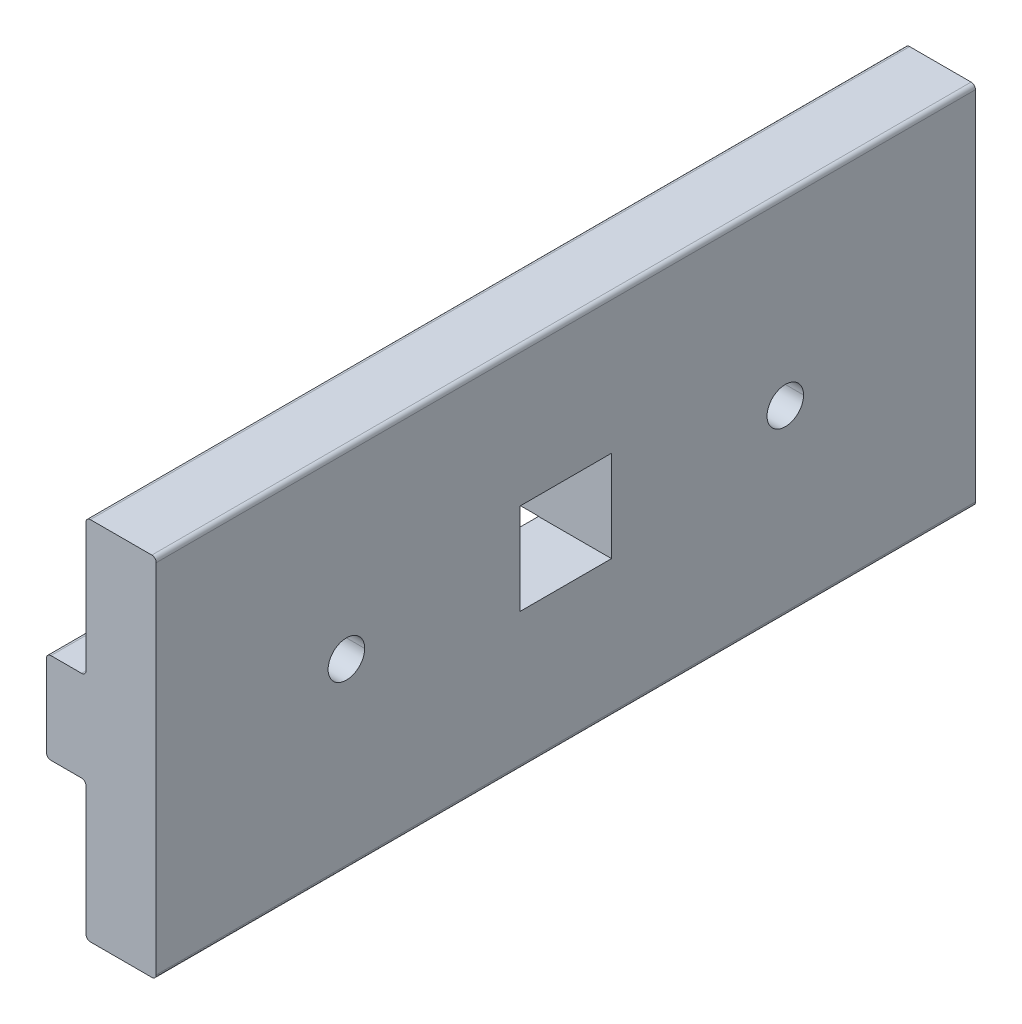
ISO-10303-21;
HEADER;
FILE_DESCRIPTION(('STEP AP214'),'2;1');
FILE_NAME('part.step','',(''),(''),'','','');
FILE_SCHEMA(('AUTOMOTIVE_DESIGN { 1 0 10303 214 1 1 1 1 }'));
ENDSEC;
DATA;
#1=APPLICATION_CONTEXT('core data for automotive mechanical design processes');
#2=APPLICATION_PROTOCOL_DEFINITION('international standard','automotive_design',2000,#1);
#3=PRODUCT_CONTEXT('',#1,'mechanical');
#4=PRODUCT('Part','Part','',(#3));
#5=PRODUCT_RELATED_PRODUCT_CATEGORY('part','',(#4));
#6=PRODUCT_DEFINITION_FORMATION('','',#4);
#7=PRODUCT_DEFINITION_CONTEXT('part definition',#1,'design');
#8=PRODUCT_DEFINITION('design','',#6,#7);
#9=PRODUCT_DEFINITION_SHAPE('','',#8);
#10=(LENGTH_UNIT() NAMED_UNIT(*) SI_UNIT(.MILLI.,.METRE.));
#11=(NAMED_UNIT(*) PLANE_ANGLE_UNIT() SI_UNIT($,.RADIAN.));
#12=(NAMED_UNIT(*) SI_UNIT($,.STERADIAN.) SOLID_ANGLE_UNIT());
#13=UNCERTAINTY_MEASURE_WITH_UNIT(LENGTH_MEASURE(1.E-05),#10,'distance_accuracy_value','');
#14=(GEOMETRIC_REPRESENTATION_CONTEXT(3) GLOBAL_UNCERTAINTY_ASSIGNED_CONTEXT((#13)) GLOBAL_UNIT_ASSIGNED_CONTEXT((#10,
#11,#12)) REPRESENTATION_CONTEXT('',''));
#15=CARTESIAN_POINT('',(0.,0.,0.));
#16=DIRECTION('',(0.,0.,1.));
#17=DIRECTION('',(1.,0.,0.));
#18=AXIS2_PLACEMENT_3D('',#15,#16,#17);
#19=CARTESIAN_POINT('',(-3.04800000000016,3.55600000000016,35.56));
#20=DIRECTION('',(0.,0.,-1.));
#21=DIRECTION('',(0.707106781186547,-0.707106781186548,0.));
#22=AXIS2_PLACEMENT_3D('',#19,#20,#21);
#23=CYLINDRICAL_SURFACE('',#22,0.380999999999846);
#24=CARTESIAN_POINT('',(-3.04800000000016,3.55600000000016,3.9624));
#25=DIRECTION('',(0.,0.,-1.));
#26=DIRECTION('',(-1.,0.,0.));
#27=AXIS2_PLACEMENT_3D('',#24,#25,#26);
#28=CIRCLE('',#27,0.380999999999846);
#29=CARTESIAN_POINT('',(-3.429,3.55600000000016,3.9624));
#30=VERTEX_POINT('',#29);
#31=CARTESIAN_POINT('',(-3.048,3.937,3.9624));
#32=VERTEX_POINT('',#31);
#33=EDGE_CURVE('E11',#30,#32,#28,.T.);
#34=ORIENTED_EDGE('',*,*,#33,.F.);
#35=DIRECTION('',(0.,0.,-1.));
#36=VECTOR('',#35,1.);
#37=CARTESIAN_POINT('',(-3.429,3.556,35.56));
#38=LINE('',#37,#36);
#39=CARTESIAN_POINT('',(-3.429,3.556,35.56));
#40=VERTEX_POINT('',#39);
#41=EDGE_CURVE('E25',#40,#30,#38,.T.);
#42=ORIENTED_EDGE('',*,*,#41,.F.);
#43=CARTESIAN_POINT('',(-3.04800000000016,3.55600000000016,35.56));
#44=DIRECTION('',(0.,0.,1.));
#45=DIRECTION('',(1.,0.,0.));
#46=AXIS2_PLACEMENT_3D('',#43,#44,#45);
#47=CIRCLE('',#46,0.380999999999846);
#48=CARTESIAN_POINT('',(-3.048,3.937,35.56));
#49=VERTEX_POINT('',#48);
#50=EDGE_CURVE('E601',#49,#40,#47,.T.);
#51=ORIENTED_EDGE('',*,*,#50,.F.);
#52=DIRECTION('',(0.,0.,-1.));
#53=VECTOR('',#52,1.);
#54=CARTESIAN_POINT('',(-3.048,3.937,35.56));
#55=LINE('',#54,#53);
#56=EDGE_CURVE('E597',#49,#32,#55,.T.);
#57=ORIENTED_EDGE('',*,*,#56,.T.);
#58=EDGE_LOOP('',(#34,#42,#51,#57));
#59=FACE_BOUND('',#58,.T.);
#60=ADVANCED_FACE('F17',(#59),#23,.T.);
#61=CARTESIAN_POINT('',(-0.381,3.937,35.56));
#62=DIRECTION('',(0.,-1.,0.));
#63=DIRECTION('',(0.,0.,-1.));
#64=AXIS2_PLACEMENT_3D('',#61,#62,#63);
#65=PLANE('',#64);
#66=DIRECTION('',(1.,0.,0.));
#67=VECTOR('',#66,1.);
#68=CARTESIAN_POINT('',(-0.381,3.937,3.9624));
#69=LINE('',#68,#67);
#70=CARTESIAN_POINT('',(-0.381,3.937,3.9624));
#71=VERTEX_POINT('',#70);
#72=EDGE_CURVE('E592',#32,#71,#69,.T.);
#73=ORIENTED_EDGE('',*,*,#72,.F.);
#74=ORIENTED_EDGE('',*,*,#56,.F.);
#75=DIRECTION('',(-1.,0.,0.));
#76=VECTOR('',#75,1.);
#77=CARTESIAN_POINT('',(-0.381,3.937,35.56));
#78=LINE('',#77,#76);
#79=CARTESIAN_POINT('',(-0.381,3.937,35.56));
#80=VERTEX_POINT('',#79);
#81=EDGE_CURVE('E587',#80,#49,#78,.T.);
#82=ORIENTED_EDGE('',*,*,#81,.F.);
#83=DIRECTION('',(0.,0.,-1.));
#84=VECTOR('',#83,1.);
#85=CARTESIAN_POINT('',(-0.381,3.937,35.56));
#86=LINE('',#85,#84);
#87=EDGE_CURVE('E583',#80,#71,#86,.T.);
#88=ORIENTED_EDGE('',*,*,#87,.T.);
#89=EDGE_LOOP('',(#73,#74,#82,#88));
#90=FACE_BOUND('',#89,.T.);
#91=ADVANCED_FACE('F686',(#90),#65,.F.);
#92=CARTESIAN_POINT('',(-0.380999999999924,4.31799999999993,35.56));
#93=DIRECTION('',(0.,0.,-1.));
#94=DIRECTION('',(-0.707106781186546,0.707106781186549,0.));
#95=AXIS2_PLACEMENT_3D('',#92,#93,#94);
#96=CYLINDRICAL_SURFACE('',#95,0.380999999999924);
#97=DIRECTION('',(0.,0.,1.));
#98=VECTOR('',#97,1.);
#99=CARTESIAN_POINT('',(-0.244216813898719,3.9624,35.56));
#100=LINE('',#99,#98);
#101=CARTESIAN_POINT('',(-0.244216813898719,3.9624,-3.9624));
#102=VERTEX_POINT('',#101);
#103=CARTESIAN_POINT('',(-0.244216813898719,3.9624,3.9624));
#104=VERTEX_POINT('',#103);
#105=EDGE_CURVE('E579',#102,#104,#100,.T.);
#106=ORIENTED_EDGE('',*,*,#105,.T.);
#107=CARTESIAN_POINT('',(-0.380999999999924,4.31799999999993,3.9624));
#108=DIRECTION('',(0.,0.,-1.));
#109=DIRECTION('',(-1.,0.,0.));
#110=AXIS2_PLACEMENT_3D('',#107,#108,#109);
#111=CIRCLE('',#110,0.380999999999924);
#112=EDGE_CURVE('E574',#104,#71,#111,.T.);
#113=ORIENTED_EDGE('',*,*,#112,.T.);
#114=ORIENTED_EDGE('',*,*,#87,.F.);
#115=CARTESIAN_POINT('',(-0.380999999999924,4.31799999999993,35.56));
#116=DIRECTION('',(0.,0.,1.));
#117=DIRECTION('',(1.,0.,0.));
#118=AXIS2_PLACEMENT_3D('',#115,#116,#117);
#119=CIRCLE('',#118,0.380999999999924);
#120=CARTESIAN_POINT('',(0.,4.318,35.56));
#121=VERTEX_POINT('',#120);
#122=EDGE_CURVE('E570',#80,#121,#119,.T.);
#123=ORIENTED_EDGE('',*,*,#122,.T.);
#124=DIRECTION('',(0.,0.,-1.));
#125=VECTOR('',#124,1.);
#126=CARTESIAN_POINT('',(0.,4.318,35.56));
#127=LINE('',#126,#125);
#128=CARTESIAN_POINT('',(0.,4.318,-35.56));
#129=VERTEX_POINT('',#128);
#130=EDGE_CURVE('E566',#121,#129,#127,.T.);
#131=ORIENTED_EDGE('',*,*,#130,.T.);
#132=CARTESIAN_POINT('',(-0.380999999999924,4.31799999999993,-35.56));
#133=DIRECTION('',(0.,0.,1.));
#134=DIRECTION('',(1.,0.,0.));
#135=AXIS2_PLACEMENT_3D('',#132,#133,#134);
#136=CIRCLE('',#135,0.380999999999924);
#137=CARTESIAN_POINT('',(-0.381,3.937,-35.56));
#138=VERTEX_POINT('',#137);
#139=EDGE_CURVE('E561',#138,#129,#136,.T.);
#140=ORIENTED_EDGE('',*,*,#139,.F.);
#141=DIRECTION('',(0.,0.,-1.));
#142=VECTOR('',#141,1.);
#143=CARTESIAN_POINT('',(-0.381,3.937,35.56));
#144=LINE('',#143,#142);
#145=CARTESIAN_POINT('',(-0.381,3.937,-3.9624));
#146=VERTEX_POINT('',#145);
#147=EDGE_CURVE('E556',#146,#138,#144,.T.);
#148=ORIENTED_EDGE('',*,*,#147,.F.);
#149=CARTESIAN_POINT('',(-0.380999999999924,4.31799999999993,-3.9624));
#150=DIRECTION('',(0.,0.,1.));
#151=DIRECTION('',(1.,0.,0.));
#152=AXIS2_PLACEMENT_3D('',#149,#150,#151);
#153=CIRCLE('',#152,0.380999999999924);
#154=EDGE_CURVE('E552',#146,#102,#153,.T.);
#155=ORIENTED_EDGE('',*,*,#154,.T.);
#156=EDGE_LOOP('',(#106,#113,#114,#123,#131,#140,#148,#155));
#157=FACE_BOUND('',#156,.T.);
#158=ADVANCED_FACE('F675',(#157),#96,.F.);
#159=CARTESIAN_POINT('',(7.62,-3.9624,-3.9624));
#160=DIRECTION('',(0.,0.,1.));
#161=DIRECTION('',(1.,0.,0.));
#162=AXIS2_PLACEMENT_3D('',#159,#160,#161);
#163=PLANE('',#162);
#164=DIRECTION('',(0.,1.,0.));
#165=VECTOR('',#164,1.);
#166=CARTESIAN_POINT('',(6.096,-15.494,-3.9624));
#167=LINE('',#166,#165);
#168=CARTESIAN_POINT('',(6.096,-3.9624,-3.9624));
#169=VERTEX_POINT('',#168);
#170=CARTESIAN_POINT('',(6.096,3.9624,-3.9624));
#171=VERTEX_POINT('',#170);
#172=EDGE_CURVE('E548',#169,#171,#167,.T.);
#173=ORIENTED_EDGE('',*,*,#172,.T.);
#174=DIRECTION('',(-1.,0.,0.));
#175=VECTOR('',#174,1.);
#176=CARTESIAN_POINT('',(7.62,3.9624,-3.9624));
#177=LINE('',#176,#175);
#178=EDGE_CURVE('E543',#171,#102,#177,.T.);
#179=ORIENTED_EDGE('',*,*,#178,.T.);
#180=ORIENTED_EDGE('',*,*,#154,.F.);
#181=DIRECTION('',(-1.,0.,0.));
#182=VECTOR('',#181,1.);
#183=CARTESIAN_POINT('',(-0.381,3.937,-3.9624));
#184=LINE('',#183,#182);
#185=CARTESIAN_POINT('',(-3.048,3.937,-3.9624));
#186=VERTEX_POINT('',#185);
#187=EDGE_CURVE('E539',#146,#186,#184,.T.);
#188=ORIENTED_EDGE('',*,*,#187,.T.);
#189=CARTESIAN_POINT('',(-3.04800000000016,3.55600000000016,-3.9624));
#190=DIRECTION('',(0.,0.,1.));
#191=DIRECTION('',(1.,0.,0.));
#192=AXIS2_PLACEMENT_3D('',#189,#190,#191);
#193=CIRCLE('',#192,0.380999999999846);
#194=CARTESIAN_POINT('',(-3.429,3.556,-3.9624));
#195=VERTEX_POINT('',#194);
#196=EDGE_CURVE('E535',#186,#195,#193,.T.);
#197=ORIENTED_EDGE('',*,*,#196,.T.);
#198=DIRECTION('',(0.,-1.,0.));
#199=VECTOR('',#198,1.);
#200=CARTESIAN_POINT('',(-3.429,3.556,-3.9624));
#201=LINE('',#200,#199);
#202=CARTESIAN_POINT('',(-3.429,-3.556,-3.9624));
#203=VERTEX_POINT('',#202);
#204=EDGE_CURVE('E531',#195,#203,#201,.T.);
#205=ORIENTED_EDGE('',*,*,#204,.T.);
#206=CARTESIAN_POINT('',(-3.04800000000016,-3.55600000000016,-3.9624));
#207=DIRECTION('',(0.,0.,1.));
#208=DIRECTION('',(1.,0.,0.));
#209=AXIS2_PLACEMENT_3D('',#206,#207,#208);
#210=CIRCLE('',#209,0.380999999999846);
#211=CARTESIAN_POINT('',(-3.048,-3.937,-3.9624));
#212=VERTEX_POINT('',#211);
#213=EDGE_CURVE('E527',#203,#212,#210,.T.);
#214=ORIENTED_EDGE('',*,*,#213,.T.);
#215=DIRECTION('',(1.,0.,0.));
#216=VECTOR('',#215,1.);
#217=CARTESIAN_POINT('',(-3.048,-3.937,-3.9624));
#218=LINE('',#217,#216);
#219=CARTESIAN_POINT('',(-0.381,-3.937,-3.9624));
#220=VERTEX_POINT('',#219);
#221=EDGE_CURVE('E523',#212,#220,#218,.T.);
#222=ORIENTED_EDGE('',*,*,#221,.T.);
#223=CARTESIAN_POINT('',(-0.380999999999924,-4.31799999999993,-3.9624));
#224=DIRECTION('',(0.,0.,1.));
#225=DIRECTION('',(1.,0.,0.));
#226=AXIS2_PLACEMENT_3D('',#223,#224,#225);
#227=CIRCLE('',#226,0.380999999999923);
#228=CARTESIAN_POINT('',(-0.244216813898721,-3.9624,-3.9624));
#229=VERTEX_POINT('',#228);
#230=EDGE_CURVE('E518',#229,#220,#227,.T.);
#231=ORIENTED_EDGE('',*,*,#230,.F.);
#232=DIRECTION('',(-1.,0.,0.));
#233=VECTOR('',#232,1.);
#234=CARTESIAN_POINT('',(7.62,-3.9624,-3.9624));
#235=LINE('',#234,#233);
#236=EDGE_CURVE('E513',#169,#229,#235,.T.);
#237=ORIENTED_EDGE('',*,*,#236,.F.);
#238=EDGE_LOOP('',(#173,#179,#180,#188,#197,#205,#214,#222,#231,#237));
#239=FACE_BOUND('',#238,.T.);
#240=ADVANCED_FACE('F669',(#239),#163,.T.);
#241=CARTESIAN_POINT('',(7.62,-3.9624,3.9624));
#242=DIRECTION('',(0.,1.,0.));
#243=DIRECTION('',(0.,0.,1.));
#244=AXIS2_PLACEMENT_3D('',#241,#242,#243);
#245=PLANE('',#244);
#246=DIRECTION('',(-1.,0.,0.));
#247=VECTOR('',#246,1.);
#248=CARTESIAN_POINT('',(7.62,-3.9624,3.9624));
#249=LINE('',#248,#247);
#250=CARTESIAN_POINT('',(6.096,-3.9624,3.9624));
#251=VERTEX_POINT('',#250);
#252=CARTESIAN_POINT('',(-0.244216813898717,-3.9624,3.9624));
#253=VERTEX_POINT('',#252);
#254=EDGE_CURVE('E508',#251,#253,#249,.T.);
#255=ORIENTED_EDGE('',*,*,#254,.F.);
#256=DIRECTION('',(0.,0.,-1.));
#257=VECTOR('',#256,1.);
#258=CARTESIAN_POINT('',(6.096,-3.9624,35.56));
#259=LINE('',#258,#257);
#260=EDGE_CURVE('E503',#251,#169,#259,.T.);
#261=ORIENTED_EDGE('',*,*,#260,.T.);
#262=ORIENTED_EDGE('',*,*,#236,.T.);
#263=DIRECTION('',(0.,0.,-1.));
#264=VECTOR('',#263,1.);
#265=CARTESIAN_POINT('',(-0.244216813898721,-3.9624,35.56));
#266=LINE('',#265,#264);
#267=EDGE_CURVE('E498',#253,#229,#266,.T.);
#268=ORIENTED_EDGE('',*,*,#267,.F.);
#269=EDGE_LOOP('',(#255,#261,#262,#268));
#270=FACE_BOUND('',#269,.T.);
#271=ADVANCED_FACE('F736',(#270),#245,.T.);
#272=CARTESIAN_POINT('',(-0.380999999999924,-4.31799999999993,35.56));
#273=DIRECTION('',(0.,0.,-1.));
#274=DIRECTION('',(-0.707106781186546,-0.707106781186549,0.));
#275=AXIS2_PLACEMENT_3D('',#272,#273,#274);
#276=CYLINDRICAL_SURFACE('',#275,0.380999999999923);
#277=DIRECTION('',(0.,0.,-1.));
#278=VECTOR('',#277,1.);
#279=CARTESIAN_POINT('',(-0.381,-3.937,35.56));
#280=LINE('',#279,#278);
#281=CARTESIAN_POINT('',(-0.381,-3.937,35.56));
#282=VERTEX_POINT('',#281);
#283=CARTESIAN_POINT('',(-0.381,-3.937,3.9624));
#284=VERTEX_POINT('',#283);
#285=EDGE_CURVE('E494',#282,#284,#280,.T.);
#286=ORIENTED_EDGE('',*,*,#285,.T.);
#287=CARTESIAN_POINT('',(-0.380999999999924,-4.31799999999993,3.9624));
#288=DIRECTION('',(0.,0.,-1.));
#289=DIRECTION('',(-1.,0.,0.));
#290=AXIS2_PLACEMENT_3D('',#287,#288,#289);
#291=CIRCLE('',#290,0.380999999999923);
#292=EDGE_CURVE('E489',#284,#253,#291,.T.);
#293=ORIENTED_EDGE('',*,*,#292,.T.);
#294=ORIENTED_EDGE('',*,*,#267,.T.);
#295=ORIENTED_EDGE('',*,*,#230,.T.);
#296=DIRECTION('',(0.,0.,-1.));
#297=VECTOR('',#296,1.);
#298=CARTESIAN_POINT('',(-0.381,-3.937,35.56));
#299=LINE('',#298,#297);
#300=CARTESIAN_POINT('',(-0.381,-3.937,-35.56));
#301=VERTEX_POINT('',#300);
#302=EDGE_CURVE('E485',#220,#301,#299,.T.);
#303=ORIENTED_EDGE('',*,*,#302,.T.);
#304=CARTESIAN_POINT('',(-0.380999999999924,-4.31799999999993,-35.56));
#305=DIRECTION('',(0.,0.,1.));
#306=DIRECTION('',(1.,0.,0.));
#307=AXIS2_PLACEMENT_3D('',#304,#305,#306);
#308=CIRCLE('',#307,0.380999999999923);
#309=CARTESIAN_POINT('',(0.,-4.318,-35.56));
#310=VERTEX_POINT('',#309);
#311=EDGE_CURVE('E481',#310,#301,#308,.T.);
#312=ORIENTED_EDGE('',*,*,#311,.F.);
#313=DIRECTION('',(0.,0.,-1.));
#314=VECTOR('',#313,1.);
#315=CARTESIAN_POINT('',(0.,-4.318,35.56));
#316=LINE('',#315,#314);
#317=CARTESIAN_POINT('',(0.,-4.318,35.56));
#318=VERTEX_POINT('',#317);
#319=EDGE_CURVE('E232',#318,#310,#316,.T.);
#320=ORIENTED_EDGE('',*,*,#319,.F.);
#321=CARTESIAN_POINT('',(-0.380999999999924,-4.31799999999993,35.56));
#322=DIRECTION('',(0.,0.,1.));
#323=DIRECTION('',(1.,0.,0.));
#324=AXIS2_PLACEMENT_3D('',#321,#322,#323);
#325=CIRCLE('',#324,0.380999999999923);
#326=EDGE_CURVE('E474',#318,#282,#325,.T.);
#327=ORIENTED_EDGE('',*,*,#326,.T.);
#328=EDGE_LOOP('',(#286,#293,#294,#295,#303,#312,#320,#327));
#329=FACE_BOUND('',#328,.T.);
#330=ADVANCED_FACE('F631',(#329),#276,.F.);
#331=CARTESIAN_POINT('',(-3.04800000000016,3.55600000000016,35.56));
#332=DIRECTION('',(0.,0.,1.));
#333=DIRECTION('',(1.,0.,0.));
#334=AXIS2_PLACEMENT_3D('',#331,#332,#333);
#335=PLANE('',#334);
#336=ORIENTED_EDGE('',*,*,#50,.T.);
#337=DIRECTION('',(0.,-1.,0.));
#338=VECTOR('',#337,1.);
#339=CARTESIAN_POINT('',(-3.429,3.556,35.56));
#340=LINE('',#339,#338);
#341=CARTESIAN_POINT('',(-3.429,-3.556,35.56));
#342=VERTEX_POINT('',#341);
#343=EDGE_CURVE('E470',#40,#342,#340,.T.);
#344=ORIENTED_EDGE('',*,*,#343,.T.);
#345=CARTESIAN_POINT('',(-3.04800000000016,-3.55600000000016,35.56));
#346=DIRECTION('',(0.,0.,1.));
#347=DIRECTION('',(1.,0.,0.));
#348=AXIS2_PLACEMENT_3D('',#345,#346,#347);
#349=CIRCLE('',#348,0.380999999999846);
#350=CARTESIAN_POINT('',(-3.048,-3.937,35.56));
#351=VERTEX_POINT('',#350);
#352=EDGE_CURVE('E466',#342,#351,#349,.T.);
#353=ORIENTED_EDGE('',*,*,#352,.T.);
#354=DIRECTION('',(1.,0.,0.));
#355=VECTOR('',#354,1.);
#356=CARTESIAN_POINT('',(-3.048,-3.937,35.56));
#357=LINE('',#356,#355);
#358=EDGE_CURVE('E461',#351,#282,#357,.T.);
#359=ORIENTED_EDGE('',*,*,#358,.T.);
#360=ORIENTED_EDGE('',*,*,#326,.F.);
#361=DIRECTION('',(0.,-1.,0.));
#362=VECTOR('',#361,1.);
#363=CARTESIAN_POINT('',(0.,-4.318,35.56));
#364=LINE('',#363,#362);
#365=CARTESIAN_POINT('',(0.,-15.494,35.56));
#366=VERTEX_POINT('',#365);
#367=EDGE_CURVE('E457',#318,#366,#364,.T.);
#368=ORIENTED_EDGE('',*,*,#367,.T.);
#369=CARTESIAN_POINT('',(0.380999999999924,-15.494,35.56));
#370=DIRECTION('',(0.,0.,1.));
#371=DIRECTION('',(1.,0.,0.));
#372=AXIS2_PLACEMENT_3D('',#369,#370,#371);
#373=CIRCLE('',#372,0.380999999999924);
#374=CARTESIAN_POINT('',(0.381,-15.875,35.56));
#375=VERTEX_POINT('',#374);
#376=EDGE_CURVE('E225',#366,#375,#373,.T.);
#377=ORIENTED_EDGE('',*,*,#376,.T.);
#378=DIRECTION('',(1.,0.,0.));
#379=VECTOR('',#378,1.);
#380=CARTESIAN_POINT('',(0.381,-15.875,35.56));
#381=LINE('',#380,#379);
#382=CARTESIAN_POINT('',(5.715,-15.875,35.56));
#383=VERTEX_POINT('',#382);
#384=EDGE_CURVE('E450',#375,#383,#381,.T.);
#385=ORIENTED_EDGE('',*,*,#384,.T.);
#386=CARTESIAN_POINT('',(5.71500000000016,-15.494,35.56));
#387=DIRECTION('',(0.,0.,1.));
#388=DIRECTION('',(1.,0.,0.));
#389=AXIS2_PLACEMENT_3D('',#386,#387,#388);
#390=CIRCLE('',#389,0.380999999999847);
#391=CARTESIAN_POINT('',(6.096,-15.494,35.56));
#392=VERTEX_POINT('',#391);
#393=EDGE_CURVE('E446',#383,#392,#390,.T.);
#394=ORIENTED_EDGE('',*,*,#393,.T.);
#395=DIRECTION('',(0.,1.,0.));
#396=VECTOR('',#395,1.);
#397=CARTESIAN_POINT('',(6.096,-15.494,35.56));
#398=LINE('',#397,#396);
#399=CARTESIAN_POINT('',(6.096,15.494,35.56));
#400=VERTEX_POINT('',#399);
#401=EDGE_CURVE('E442',#392,#400,#398,.T.);
#402=ORIENTED_EDGE('',*,*,#401,.T.);
#403=CARTESIAN_POINT('',(5.71500000000016,15.494,35.56));
#404=DIRECTION('',(0.,0.,1.));
#405=DIRECTION('',(1.,0.,0.));
#406=AXIS2_PLACEMENT_3D('',#403,#404,#405);
#407=CIRCLE('',#406,0.380999999999844);
#408=CARTESIAN_POINT('',(5.715,15.875,35.56));
#409=VERTEX_POINT('',#408);
#410=EDGE_CURVE('E438',#400,#409,#407,.T.);
#411=ORIENTED_EDGE('',*,*,#410,.T.);
#412=DIRECTION('',(-1.,0.,0.));
#413=VECTOR('',#412,1.);
#414=CARTESIAN_POINT('',(5.715,15.875,35.56));
#415=LINE('',#414,#413);
#416=CARTESIAN_POINT('',(0.381,15.875,35.56));
#417=VERTEX_POINT('',#416);
#418=EDGE_CURVE('E434',#409,#417,#415,.T.);
#419=ORIENTED_EDGE('',*,*,#418,.T.);
#420=CARTESIAN_POINT('',(0.380999999999918,15.494,35.56));
#421=DIRECTION('',(0.,0.,1.));
#422=DIRECTION('',(1.,0.,0.));
#423=AXIS2_PLACEMENT_3D('',#420,#421,#422);
#424=CIRCLE('',#423,0.380999999999918);
#425=CARTESIAN_POINT('',(0.,15.494,35.56));
#426=VERTEX_POINT('',#425);
#427=EDGE_CURVE('E430',#417,#426,#424,.T.);
#428=ORIENTED_EDGE('',*,*,#427,.T.);
#429=DIRECTION('',(0.,-1.,0.));
#430=VECTOR('',#429,1.);
#431=CARTESIAN_POINT('',(0.,15.494,35.56));
#432=LINE('',#431,#430);
#433=EDGE_CURVE('E425',#426,#121,#432,.T.);
#434=ORIENTED_EDGE('',*,*,#433,.T.);
#435=ORIENTED_EDGE('',*,*,#122,.F.);
#436=ORIENTED_EDGE('',*,*,#81,.T.);
#437=EDGE_LOOP('',(#336,#344,#353,#359,#360,#368,#377,#385,#394,#402,#411,#419,#428,#434,#435,#436));
#438=FACE_BOUND('',#437,.T.);
#439=ADVANCED_FACE('F625',(#438),#335,.T.);
#440=CARTESIAN_POINT('',(0.,15.494,35.56));
#441=DIRECTION('',(1.,0.,0.));
#442=DIRECTION('',(0.,0.,-1.));
#443=AXIS2_PLACEMENT_3D('',#440,#441,#442);
#444=PLANE('',#443);
#445=DIRECTION('',(0.,-1.,0.));
#446=VECTOR('',#445,1.);
#447=CARTESIAN_POINT('',(0.,15.494,-35.56));
#448=LINE('',#447,#446);
#449=CARTESIAN_POINT('',(0.,15.494,-35.56));
#450=VERTEX_POINT('',#449);
#451=EDGE_CURVE('E420',#450,#129,#448,.T.);
#452=ORIENTED_EDGE('',*,*,#451,.T.);
#453=ORIENTED_EDGE('',*,*,#130,.F.);
#454=ORIENTED_EDGE('',*,*,#433,.F.);
#455=DIRECTION('',(0.,0.,-1.));
#456=VECTOR('',#455,1.);
#457=CARTESIAN_POINT('',(0.,15.494,35.56));
#458=LINE('',#457,#456);
#459=EDGE_CURVE('E416',#426,#450,#458,.T.);
#460=ORIENTED_EDGE('',*,*,#459,.T.);
#461=EDGE_LOOP('',(#452,#453,#454,#460));
#462=FACE_BOUND('',#461,.T.);
#463=ADVANCED_FACE('F693',(#462),#444,.F.);
#464=CARTESIAN_POINT('',(0.380999999999918,15.494,35.56));
#465=DIRECTION('',(0.,0.,-1.));
#466=DIRECTION('',(0.707106781186471,-0.707106781186624,0.));
#467=AXIS2_PLACEMENT_3D('',#464,#465,#466);
#468=CYLINDRICAL_SURFACE('',#467,0.380999999999918);
#469=CARTESIAN_POINT('',(0.380999999999918,15.494,-35.56));
#470=DIRECTION('',(0.,0.,1.));
#471=DIRECTION('',(1.,0.,0.));
#472=AXIS2_PLACEMENT_3D('',#469,#470,#471);
#473=CIRCLE('',#472,0.380999999999918);
#474=CARTESIAN_POINT('',(0.381,15.875,-35.56));
#475=VERTEX_POINT('',#474);
#476=EDGE_CURVE('E411',#475,#450,#473,.T.);
#477=ORIENTED_EDGE('',*,*,#476,.T.);
#478=ORIENTED_EDGE('',*,*,#459,.F.);
#479=ORIENTED_EDGE('',*,*,#427,.F.);
#480=DIRECTION('',(0.,0.,-1.));
#481=VECTOR('',#480,1.);
#482=CARTESIAN_POINT('',(0.381,15.875,35.56));
#483=LINE('',#482,#481);
#484=EDGE_CURVE('E407',#417,#475,#483,.T.);
#485=ORIENTED_EDGE('',*,*,#484,.T.);
#486=EDGE_LOOP('',(#477,#478,#479,#485));
#487=FACE_BOUND('',#486,.T.);
#488=ADVANCED_FACE('F698',(#487),#468,.T.);
#489=CARTESIAN_POINT('',(5.715,15.875,35.56));
#490=DIRECTION('',(0.,-1.,0.));
#491=DIRECTION('',(0.,0.,-1.));
#492=AXIS2_PLACEMENT_3D('',#489,#490,#491);
#493=PLANE('',#492);
#494=DIRECTION('',(-1.,0.,0.));
#495=VECTOR('',#494,1.);
#496=CARTESIAN_POINT('',(5.715,15.875,-35.56));
#497=LINE('',#496,#495);
#498=CARTESIAN_POINT('',(5.715,15.875,-35.56));
#499=VERTEX_POINT('',#498);
#500=EDGE_CURVE('E402',#499,#475,#497,.T.);
#501=ORIENTED_EDGE('',*,*,#500,.T.);
#502=ORIENTED_EDGE('',*,*,#484,.F.);
#503=ORIENTED_EDGE('',*,*,#418,.F.);
#504=DIRECTION('',(0.,0.,-1.));
#505=VECTOR('',#504,1.);
#506=CARTESIAN_POINT('',(5.715,15.875,35.56));
#507=LINE('',#506,#505);
#508=EDGE_CURVE('E398',#409,#499,#507,.T.);
#509=ORIENTED_EDGE('',*,*,#508,.T.);
#510=EDGE_LOOP('',(#501,#502,#503,#509));
#511=FACE_BOUND('',#510,.T.);
#512=ADVANCED_FACE('F702',(#511),#493,.F.);
#513=CARTESIAN_POINT('',(5.71500000000016,15.494,35.56));
#514=DIRECTION('',(0.,0.,-1.));
#515=DIRECTION('',(-0.707106781186399,-0.707106781186696,0.));
#516=AXIS2_PLACEMENT_3D('',#513,#514,#515);
#517=CYLINDRICAL_SURFACE('',#516,0.380999999999844);
#518=CARTESIAN_POINT('',(5.71500000000016,15.494,-35.56));
#519=DIRECTION('',(0.,0.,1.));
#520=DIRECTION('',(1.,0.,0.));
#521=AXIS2_PLACEMENT_3D('',#518,#519,#520);
#522=CIRCLE('',#521,0.380999999999844);
#523=CARTESIAN_POINT('',(6.096,15.494,-35.56));
#524=VERTEX_POINT('',#523);
#525=EDGE_CURVE('E393',#524,#499,#522,.T.);
#526=ORIENTED_EDGE('',*,*,#525,.T.);
#527=ORIENTED_EDGE('',*,*,#508,.F.);
#528=ORIENTED_EDGE('',*,*,#410,.F.);
#529=DIRECTION('',(0.,0.,-1.));
#530=VECTOR('',#529,1.);
#531=CARTESIAN_POINT('',(6.096,15.494,35.56));
#532=LINE('',#531,#530);
#533=EDGE_CURVE('E389',#400,#524,#532,.T.);
#534=ORIENTED_EDGE('',*,*,#533,.T.);
#535=EDGE_LOOP('',(#526,#527,#528,#534));
#536=FACE_BOUND('',#535,.T.);
#537=ADVANCED_FACE('F706',(#536),#517,.T.);
#538=CARTESIAN_POINT('',(6.096,-15.494,35.56));
#539=DIRECTION('',(-1.,0.,0.));
#540=DIRECTION('',(0.,0.,1.));
#541=AXIS2_PLACEMENT_3D('',#538,#539,#540);
#542=PLANE('',#541);
#543=DIRECTION('',(0.,1.,0.));
#544=VECTOR('',#543,1.);
#545=CARTESIAN_POINT('',(6.096,-15.494,-35.56));
#546=LINE('',#545,#544);
#547=CARTESIAN_POINT('',(6.096,-15.494,-35.56));
#548=VERTEX_POINT('',#547);
#549=EDGE_CURVE('E384',#548,#524,#546,.T.);
#550=ORIENTED_EDGE('',*,*,#549,.T.);
#551=ORIENTED_EDGE('',*,*,#533,.F.);
#552=ORIENTED_EDGE('',*,*,#401,.F.);
#553=DIRECTION('',(0.,0.,-1.));
#554=VECTOR('',#553,1.);
#555=CARTESIAN_POINT('',(6.096,-15.494,35.56));
#556=LINE('',#555,#554);
#557=EDGE_CURVE('E380',#392,#548,#556,.T.);
#558=ORIENTED_EDGE('',*,*,#557,.T.);
#559=EDGE_LOOP('',(#550,#551,#552,#558));
#560=FACE_BOUND('',#559,.T.);
#561=CARTESIAN_POINT('',(6.096,0.,19.05));
#562=DIRECTION('',(1.,0.,0.));
#563=DIRECTION('',(0.,0.,-1.));
#564=AXIS2_PLACEMENT_3D('',#561,#562,#563);
#565=CIRCLE('',#564,1.5875);
#566=CARTESIAN_POINT('',(6.096,0.,20.6375));
#567=VERTEX_POINT('',#566);
#568=CARTESIAN_POINT('',(6.096,0.,17.4625));
#569=VERTEX_POINT('',#568);
#570=EDGE_CURVE('E375',#567,#569,#565,.T.);
#571=ORIENTED_EDGE('',*,*,#570,.F.);
#572=CARTESIAN_POINT('',(6.096,0.,19.05));
#573=DIRECTION('',(1.,0.,0.));
#574=DIRECTION('',(0.,0.,-1.));
#575=AXIS2_PLACEMENT_3D('',#572,#573,#574);
#576=CIRCLE('',#575,1.5875);
#577=EDGE_CURVE('E370',#569,#567,#576,.T.);
#578=ORIENTED_EDGE('',*,*,#577,.F.);
#579=EDGE_LOOP('',(#571,#578));
#580=FACE_BOUND('',#579,.T.);
#581=CARTESIAN_POINT('',(6.096,0.,-19.05));
#582=DIRECTION('',(1.,0.,0.));
#583=DIRECTION('',(0.,0.,-1.));
#584=AXIS2_PLACEMENT_3D('',#581,#582,#583);
#585=CIRCLE('',#584,1.5875);
#586=CARTESIAN_POINT('',(6.096,0.,-17.4625));
#587=VERTEX_POINT('',#586);
#588=CARTESIAN_POINT('',(6.096,0.,-20.6375));
#589=VERTEX_POINT('',#588);
#590=EDGE_CURVE('E365',#587,#589,#585,.T.);
#591=ORIENTED_EDGE('',*,*,#590,.F.);
#592=CARTESIAN_POINT('',(6.096,0.,-19.05));
#593=DIRECTION('',(1.,0.,0.));
#594=DIRECTION('',(0.,0.,-1.));
#595=AXIS2_PLACEMENT_3D('',#592,#593,#594);
#596=CIRCLE('',#595,1.5875);
#597=EDGE_CURVE('E360',#589,#587,#596,.T.);
#598=ORIENTED_EDGE('',*,*,#597,.F.);
#599=EDGE_LOOP('',(#591,#598));
#600=FACE_BOUND('',#599,.T.);
#601=DIRECTION('',(0.,0.,1.));
#602=VECTOR('',#601,1.);
#603=CARTESIAN_POINT('',(6.096,3.9624,35.56));
#604=LINE('',#603,#602);
#605=CARTESIAN_POINT('',(6.096,3.9624,3.9624));
#606=VERTEX_POINT('',#605);
#607=EDGE_CURVE('E355',#171,#606,#604,.T.);
#608=ORIENTED_EDGE('',*,*,#607,.F.);
#609=ORIENTED_EDGE('',*,*,#172,.F.);
#610=ORIENTED_EDGE('',*,*,#260,.F.);
#611=DIRECTION('',(0.,-1.,0.));
#612=VECTOR('',#611,1.);
#613=CARTESIAN_POINT('',(6.096,-15.494,3.9624));
#614=LINE('',#613,#612);
#615=EDGE_CURVE('E350',#606,#251,#614,.T.);
#616=ORIENTED_EDGE('',*,*,#615,.F.);
#617=EDGE_LOOP('',(#608,#609,#610,#616));
#618=FACE_BOUND('',#617,.T.);
#619=ADVANCED_FACE('F710',(#560,#580,#600,#618),#542,.F.);
#620=CARTESIAN_POINT('',(7.62,3.9624,3.9624));
#621=DIRECTION('',(0.,0.,-1.));
#622=DIRECTION('',(-1.,0.,0.));
#623=AXIS2_PLACEMENT_3D('',#620,#621,#622);
#624=PLANE('',#623);
#625=ORIENTED_EDGE('',*,*,#615,.T.);
#626=ORIENTED_EDGE('',*,*,#254,.T.);
#627=ORIENTED_EDGE('',*,*,#292,.F.);
#628=DIRECTION('',(-1.,0.,0.));
#629=VECTOR('',#628,1.);
#630=CARTESIAN_POINT('',(-3.048,-3.937,3.9624));
#631=LINE('',#630,#629);
#632=CARTESIAN_POINT('',(-3.048,-3.937,3.9624));
#633=VERTEX_POINT('',#632);
#634=EDGE_CURVE('E346',#284,#633,#631,.T.);
#635=ORIENTED_EDGE('',*,*,#634,.T.);
#636=CARTESIAN_POINT('',(-3.04800000000016,-3.55600000000016,3.9624));
#637=DIRECTION('',(0.,0.,-1.));
#638=DIRECTION('',(-1.,0.,0.));
#639=AXIS2_PLACEMENT_3D('',#636,#637,#638);
#640=CIRCLE('',#639,0.380999999999846);
#641=CARTESIAN_POINT('',(-3.429,-3.556,3.9624));
#642=VERTEX_POINT('',#641);
#643=EDGE_CURVE('E342',#633,#642,#640,.T.);
#644=ORIENTED_EDGE('',*,*,#643,.T.);
#645=DIRECTION('',(0.,1.,0.));
#646=VECTOR('',#645,1.);
#647=CARTESIAN_POINT('',(-3.429,3.556,3.9624));
#648=LINE('',#647,#646);
#649=EDGE_CURVE('E337',#642,#30,#648,.T.);
#650=ORIENTED_EDGE('',*,*,#649,.T.);
#651=ORIENTED_EDGE('',*,*,#33,.T.);
#652=ORIENTED_EDGE('',*,*,#72,.T.);
#653=ORIENTED_EDGE('',*,*,#112,.F.);
#654=DIRECTION('',(-1.,0.,0.));
#655=VECTOR('',#654,1.);
#656=CARTESIAN_POINT('',(7.62,3.9624,3.9624));
#657=LINE('',#656,#655);
#658=EDGE_CURVE('E332',#606,#104,#657,.T.);
#659=ORIENTED_EDGE('',*,*,#658,.F.);
#660=EDGE_LOOP('',(#625,#626,#627,#635,#644,#650,#651,#652,#653,#659));
#661=FACE_BOUND('',#660,.T.);
#662=ADVANCED_FACE('F615',(#661),#624,.T.);
#663=CARTESIAN_POINT('',(7.62,3.9624,-3.9624));
#664=DIRECTION('',(0.,-1.,0.));
#665=DIRECTION('',(0.,0.,-1.));
#666=AXIS2_PLACEMENT_3D('',#663,#664,#665);
#667=PLANE('',#666);
#668=ORIENTED_EDGE('',*,*,#607,.T.);
#669=ORIENTED_EDGE('',*,*,#658,.T.);
#670=ORIENTED_EDGE('',*,*,#105,.F.);
#671=ORIENTED_EDGE('',*,*,#178,.F.);
#672=EDGE_LOOP('',(#668,#669,#670,#671));
#673=FACE_BOUND('',#672,.T.);
#674=ADVANCED_FACE('F678',(#673),#667,.T.);
#675=CARTESIAN_POINT('',(-3.429,3.556,35.56));
#676=DIRECTION('',(1.,0.,0.));
#677=DIRECTION('',(0.,0.,-1.));
#678=AXIS2_PLACEMENT_3D('',#675,#676,#677);
#679=PLANE('',#678);
#680=CARTESIAN_POINT('',(-3.429,0.,19.05));
#681=DIRECTION('',(1.,0.,0.));
#682=DIRECTION('',(0.,0.,-1.));
#683=AXIS2_PLACEMENT_3D('',#680,#681,#682);
#684=CIRCLE('',#683,1.5875);
#685=CARTESIAN_POINT('',(-3.429,0.,17.4625));
#686=VERTEX_POINT('',#685);
#687=CARTESIAN_POINT('',(-3.429,0.,20.6375));
#688=VERTEX_POINT('',#687);
#689=EDGE_CURVE('E328',#686,#688,#684,.T.);
#690=ORIENTED_EDGE('',*,*,#689,.T.);
#691=CARTESIAN_POINT('',(-3.429,0.,19.05));
#692=DIRECTION('',(1.,0.,0.));
#693=DIRECTION('',(0.,0.,-1.));
#694=AXIS2_PLACEMENT_3D('',#691,#692,#693);
#695=CIRCLE('',#694,1.5875);
#696=EDGE_CURVE('E324',#688,#686,#695,.T.);
#697=ORIENTED_EDGE('',*,*,#696,.T.);
#698=EDGE_LOOP('',(#690,#697));
#699=FACE_BOUND('',#698,.T.);
#700=ORIENTED_EDGE('',*,*,#649,.F.);
#701=DIRECTION('',(0.,0.,-1.));
#702=VECTOR('',#701,1.);
#703=CARTESIAN_POINT('',(-3.429,-3.556,35.56));
#704=LINE('',#703,#702);
#705=EDGE_CURVE('E319',#342,#642,#704,.T.);
#706=ORIENTED_EDGE('',*,*,#705,.F.);
#707=ORIENTED_EDGE('',*,*,#343,.F.);
#708=ORIENTED_EDGE('',*,*,#41,.T.);
#709=EDGE_LOOP('',(#700,#706,#707,#708));
#710=FACE_BOUND('',#709,.T.);
#711=ADVANCED_FACE('F612',(#699,#710),#679,.F.);
#712=CARTESIAN_POINT('',(-3.04800000000016,-3.55600000000016,35.56));
#713=DIRECTION('',(0.,0.,-1.));
#714=DIRECTION('',(0.707106781186548,0.707106781186547,0.));
#715=AXIS2_PLACEMENT_3D('',#712,#713,#714);
#716=CYLINDRICAL_SURFACE('',#715,0.380999999999846);
#717=ORIENTED_EDGE('',*,*,#643,.F.);
#718=DIRECTION('',(0.,0.,-1.));
#719=VECTOR('',#718,1.);
#720=CARTESIAN_POINT('',(-3.048,-3.937,35.56));
#721=LINE('',#720,#719);
#722=EDGE_CURVE('E314',#351,#633,#721,.T.);
#723=ORIENTED_EDGE('',*,*,#722,.F.);
#724=ORIENTED_EDGE('',*,*,#352,.F.);
#725=ORIENTED_EDGE('',*,*,#705,.T.);
#726=EDGE_LOOP('',(#717,#723,#724,#725));
#727=FACE_BOUND('',#726,.T.);
#728=ADVANCED_FACE('F621',(#727),#716,.T.);
#729=CARTESIAN_POINT('',(-3.048,-3.937,35.56));
#730=DIRECTION('',(0.,1.,0.));
#731=DIRECTION('',(0.,0.,1.));
#732=AXIS2_PLACEMENT_3D('',#729,#730,#731);
#733=PLANE('',#732);
#734=ORIENTED_EDGE('',*,*,#634,.F.);
#735=ORIENTED_EDGE('',*,*,#285,.F.);
#736=ORIENTED_EDGE('',*,*,#358,.F.);
#737=ORIENTED_EDGE('',*,*,#722,.T.);
#738=EDGE_LOOP('',(#734,#735,#736,#737));
#739=FACE_BOUND('',#738,.T.);
#740=ADVANCED_FACE('F629',(#739),#733,.F.);
#741=CARTESIAN_POINT('',(6.096,0.,19.05));
#742=DIRECTION('',(1.,0.,0.));
#743=DIRECTION('',(0.,1.,0.));
#744=AXIS2_PLACEMENT_3D('',#741,#742,#743);
#745=CYLINDRICAL_SURFACE('',#744,1.5875);
#746=DIRECTION('',(1.,0.,0.));
#747=VECTOR('',#746,1.);
#748=CARTESIAN_POINT('',(-3.429,0.,20.6375));
#749=LINE('',#748,#747);
#750=EDGE_CURVE('E309',#688,#567,#749,.T.);
#751=ORIENTED_EDGE('',*,*,#750,.T.);
#752=ORIENTED_EDGE('',*,*,#570,.T.);
#753=DIRECTION('',(1.,0.,0.));
#754=VECTOR('',#753,1.);
#755=CARTESIAN_POINT('',(-3.429,0.,17.4625));
#756=LINE('',#755,#754);
#757=EDGE_CURVE('E304',#686,#569,#756,.T.);
#758=ORIENTED_EDGE('',*,*,#757,.F.);
#759=ORIENTED_EDGE('',*,*,#696,.F.);
#760=EDGE_LOOP('',(#751,#752,#758,#759));
#761=FACE_BOUND('',#760,.T.);
#762=ADVANCED_FACE('F765',(#761),#745,.F.);
#763=CARTESIAN_POINT('',(6.096,0.,19.05));
#764=DIRECTION('',(1.,0.,0.));
#765=DIRECTION('',(0.,-1.,0.));
#766=AXIS2_PLACEMENT_3D('',#763,#764,#765);
#767=CYLINDRICAL_SURFACE('',#766,1.5875);
#768=ORIENTED_EDGE('',*,*,#750,.F.);
#769=ORIENTED_EDGE('',*,*,#689,.F.);
#770=ORIENTED_EDGE('',*,*,#757,.T.);
#771=ORIENTED_EDGE('',*,*,#577,.T.);
#772=EDGE_LOOP('',(#768,#769,#770,#771));
#773=FACE_BOUND('',#772,.T.);
#774=ADVANCED_FACE('F768',(#773),#767,.F.);
#775=CARTESIAN_POINT('',(6.096,0.,-19.05));
#776=DIRECTION('',(1.,0.,0.));
#777=DIRECTION('',(0.,-1.,0.));
#778=AXIS2_PLACEMENT_3D('',#775,#776,#777);
#779=CYLINDRICAL_SURFACE('',#778,1.5875);
#780=DIRECTION('',(1.,0.,0.));
#781=VECTOR('',#780,1.);
#782=CARTESIAN_POINT('',(-3.429,0.,-17.4625));
#783=LINE('',#782,#781);
#784=CARTESIAN_POINT('',(-3.429,0.,-17.4625));
#785=VERTEX_POINT('',#784);
#786=EDGE_CURVE('E299',#785,#587,#783,.T.);
#787=ORIENTED_EDGE('',*,*,#786,.F.);
#788=CARTESIAN_POINT('',(-3.429,0.,-19.05));
#789=DIRECTION('',(1.,0.,0.));
#790=DIRECTION('',(0.,0.,-1.));
#791=AXIS2_PLACEMENT_3D('',#788,#789,#790);
#792=CIRCLE('',#791,1.5875);
#793=CARTESIAN_POINT('',(-3.429,0.,-20.6375));
#794=VERTEX_POINT('',#793);
#795=EDGE_CURVE('E294',#794,#785,#792,.T.);
#796=ORIENTED_EDGE('',*,*,#795,.F.);
#797=DIRECTION('',(1.,0.,0.));
#798=VECTOR('',#797,1.);
#799=CARTESIAN_POINT('',(-3.429,0.,-20.6375));
#800=LINE('',#799,#798);
#801=EDGE_CURVE('E289',#794,#589,#800,.T.);
#802=ORIENTED_EDGE('',*,*,#801,.T.);
#803=ORIENTED_EDGE('',*,*,#597,.T.);
#804=EDGE_LOOP('',(#787,#796,#802,#803));
#805=FACE_BOUND('',#804,.T.);
#806=ADVANCED_FACE('F772',(#805),#779,.F.);
#807=CARTESIAN_POINT('',(6.096,0.,-19.05));
#808=DIRECTION('',(1.,0.,0.));
#809=DIRECTION('',(0.,1.,0.));
#810=AXIS2_PLACEMENT_3D('',#807,#808,#809);
#811=CYLINDRICAL_SURFACE('',#810,1.5875);
#812=ORIENTED_EDGE('',*,*,#786,.T.);
#813=ORIENTED_EDGE('',*,*,#590,.T.);
#814=ORIENTED_EDGE('',*,*,#801,.F.);
#815=CARTESIAN_POINT('',(-3.429,0.,-19.05));
#816=DIRECTION('',(1.,0.,0.));
#817=DIRECTION('',(0.,0.,-1.));
#818=AXIS2_PLACEMENT_3D('',#815,#816,#817);
#819=CIRCLE('',#818,1.5875);
#820=EDGE_CURVE('E284',#785,#794,#819,.T.);
#821=ORIENTED_EDGE('',*,*,#820,.F.);
#822=EDGE_LOOP('',(#812,#813,#814,#821));
#823=FACE_BOUND('',#822,.T.);
#824=ADVANCED_FACE('F776',(#823),#811,.F.);
#825=CARTESIAN_POINT('',(-3.429,3.556,35.56));
#826=DIRECTION('',(1.,0.,0.));
#827=DIRECTION('',(0.,0.,-1.));
#828=AXIS2_PLACEMENT_3D('',#825,#826,#827);
#829=PLANE('',#828);
#830=ORIENTED_EDGE('',*,*,#795,.T.);
#831=ORIENTED_EDGE('',*,*,#820,.T.);
#832=EDGE_LOOP('',(#830,#831));
#833=FACE_BOUND('',#832,.T.);
#834=ORIENTED_EDGE('',*,*,#204,.F.);
#835=DIRECTION('',(0.,0.,-1.));
#836=VECTOR('',#835,1.);
#837=CARTESIAN_POINT('',(-3.429,3.556,35.56));
#838=LINE('',#837,#836);
#839=CARTESIAN_POINT('',(-3.429,3.556,-35.56));
#840=VERTEX_POINT('',#839);
#841=EDGE_CURVE('E280',#195,#840,#838,.T.);
#842=ORIENTED_EDGE('',*,*,#841,.T.);
#843=DIRECTION('',(0.,-1.,0.));
#844=VECTOR('',#843,1.);
#845=CARTESIAN_POINT('',(-3.429,3.556,-35.56));
#846=LINE('',#845,#844);
#847=CARTESIAN_POINT('',(-3.429,-3.556,-35.56));
#848=VERTEX_POINT('',#847);
#849=EDGE_CURVE('E276',#840,#848,#846,.T.);
#850=ORIENTED_EDGE('',*,*,#849,.T.);
#851=DIRECTION('',(0.,0.,-1.));
#852=VECTOR('',#851,1.);
#853=CARTESIAN_POINT('',(-3.429,-3.556,35.56));
#854=LINE('',#853,#852);
#855=EDGE_CURVE('E271',#203,#848,#854,.T.);
#856=ORIENTED_EDGE('',*,*,#855,.F.);
#857=EDGE_LOOP('',(#834,#842,#850,#856));
#858=FACE_BOUND('',#857,.T.);
#859=ADVANCED_FACE('F666',(#833,#858),#829,.F.);
#860=CARTESIAN_POINT('',(-3.04800000000016,-3.55600000000016,35.56));
#861=DIRECTION('',(0.,0.,-1.));
#862=DIRECTION('',(0.707106781186548,0.707106781186547,0.));
#863=AXIS2_PLACEMENT_3D('',#860,#861,#862);
#864=CYLINDRICAL_SURFACE('',#863,0.380999999999846);
#865=ORIENTED_EDGE('',*,*,#213,.F.);
#866=ORIENTED_EDGE('',*,*,#855,.T.);
#867=CARTESIAN_POINT('',(-3.04800000000016,-3.55600000000016,-35.56));
#868=DIRECTION('',(0.,0.,1.));
#869=DIRECTION('',(1.,0.,0.));
#870=AXIS2_PLACEMENT_3D('',#867,#868,#869);
#871=CIRCLE('',#870,0.380999999999846);
#872=CARTESIAN_POINT('',(-3.048,-3.937,-35.56));
#873=VERTEX_POINT('',#872);
#874=EDGE_CURVE('E267',#848,#873,#871,.T.);
#875=ORIENTED_EDGE('',*,*,#874,.T.);
#876=DIRECTION('',(0.,0.,-1.));
#877=VECTOR('',#876,1.);
#878=CARTESIAN_POINT('',(-3.048,-3.937,35.56));
#879=LINE('',#878,#877);
#880=EDGE_CURVE('E262',#212,#873,#879,.T.);
#881=ORIENTED_EDGE('',*,*,#880,.F.);
#882=EDGE_LOOP('',(#865,#866,#875,#881));
#883=FACE_BOUND('',#882,.T.);
#884=ADVANCED_FACE('F783',(#883),#864,.T.);
#885=CARTESIAN_POINT('',(-3.048,-3.937,35.56));
#886=DIRECTION('',(0.,1.,0.));
#887=DIRECTION('',(0.,0.,1.));
#888=AXIS2_PLACEMENT_3D('',#885,#886,#887);
#889=PLANE('',#888);
#890=ORIENTED_EDGE('',*,*,#221,.F.);
#891=ORIENTED_EDGE('',*,*,#880,.T.);
#892=DIRECTION('',(1.,0.,0.));
#893=VECTOR('',#892,1.);
#894=CARTESIAN_POINT('',(-3.048,-3.937,-35.56));
#895=LINE('',#894,#893);
#896=EDGE_CURVE('E257',#873,#301,#895,.T.);
#897=ORIENTED_EDGE('',*,*,#896,.T.);
#898=ORIENTED_EDGE('',*,*,#302,.F.);
#899=EDGE_LOOP('',(#890,#891,#897,#898));
#900=FACE_BOUND('',#899,.T.);
#901=ADVANCED_FACE('F787',(#900),#889,.F.);
#902=CARTESIAN_POINT('',(-3.04800000000016,3.55600000000016,-35.56));
#903=DIRECTION('',(0.,0.,1.));
#904=DIRECTION('',(1.,0.,0.));
#905=AXIS2_PLACEMENT_3D('',#902,#903,#904);
#906=PLANE('',#905);
#907=CARTESIAN_POINT('',(-3.04800000000016,3.55600000000016,-35.56));
#908=DIRECTION('',(0.,0.,1.));
#909=DIRECTION('',(1.,0.,0.));
#910=AXIS2_PLACEMENT_3D('',#907,#908,#909);
#911=CIRCLE('',#910,0.380999999999846);
#912=CARTESIAN_POINT('',(-3.048,3.937,-35.56));
#913=VERTEX_POINT('',#912);
#914=EDGE_CURVE('E252',#913,#840,#911,.T.);
#915=ORIENTED_EDGE('',*,*,#914,.F.);
#916=DIRECTION('',(-1.,0.,0.));
#917=VECTOR('',#916,1.);
#918=CARTESIAN_POINT('',(-0.381,3.937,-35.56));
#919=LINE('',#918,#917);
#920=EDGE_CURVE('E247',#138,#913,#919,.T.);
#921=ORIENTED_EDGE('',*,*,#920,.F.);
#922=ORIENTED_EDGE('',*,*,#139,.T.);
#923=ORIENTED_EDGE('',*,*,#451,.F.);
#924=ORIENTED_EDGE('',*,*,#476,.F.);
#925=ORIENTED_EDGE('',*,*,#500,.F.);
#926=ORIENTED_EDGE('',*,*,#525,.F.);
#927=ORIENTED_EDGE('',*,*,#549,.F.);
#928=CARTESIAN_POINT('',(5.71500000000016,-15.494,-35.56));
#929=DIRECTION('',(0.,0.,1.));
#930=DIRECTION('',(1.,0.,0.));
#931=AXIS2_PLACEMENT_3D('',#928,#929,#930);
#932=CIRCLE('',#931,0.380999999999847);
#933=CARTESIAN_POINT('',(5.715,-15.875,-35.56));
#934=VERTEX_POINT('',#933);
#935=EDGE_CURVE('E242',#934,#548,#932,.T.);
#936=ORIENTED_EDGE('',*,*,#935,.F.);
#937=DIRECTION('',(1.,0.,0.));
#938=VECTOR('',#937,1.);
#939=CARTESIAN_POINT('',(0.381,-15.875,-35.56));
#940=LINE('',#939,#938);
#941=CARTESIAN_POINT('',(0.381,-15.875,-35.56));
#942=VERTEX_POINT('',#941);
#943=EDGE_CURVE('E216',#942,#934,#940,.T.);
#944=ORIENTED_EDGE('',*,*,#943,.F.);
#945=CARTESIAN_POINT('',(0.380999999999924,-15.494,-35.56));
#946=DIRECTION('',(0.,0.,1.));
#947=DIRECTION('',(1.,0.,0.));
#948=AXIS2_PLACEMENT_3D('',#945,#946,#947);
#949=CIRCLE('',#948,0.380999999999924);
#950=CARTESIAN_POINT('',(0.,-15.494,-35.56));
#951=VERTEX_POINT('',#950);
#952=EDGE_CURVE('E209',#951,#942,#949,.T.);
#953=ORIENTED_EDGE('',*,*,#952,.F.);
#954=DIRECTION('',(0.,-1.,0.));
#955=VECTOR('',#954,1.);
#956=CARTESIAN_POINT('',(0.,-4.318,-35.56));
#957=LINE('',#956,#955);
#958=EDGE_CURVE('E214',#310,#951,#957,.T.);
#959=ORIENTED_EDGE('',*,*,#958,.F.);
#960=ORIENTED_EDGE('',*,*,#311,.T.);
#961=ORIENTED_EDGE('',*,*,#896,.F.);
#962=ORIENTED_EDGE('',*,*,#874,.F.);
#963=ORIENTED_EDGE('',*,*,#849,.F.);
#964=EDGE_LOOP('',(#915,#921,#922,#923,#924,#925,#926,#927,#936,#944,#953,#959,#960,#961,#962,#963));
#965=FACE_BOUND('',#964,.T.);
#966=ADVANCED_FACE('F211',(#965),#906,.F.);
#967=CARTESIAN_POINT('',(0.,-4.318,35.56));
#968=DIRECTION('',(1.,0.,0.));
#969=DIRECTION('',(0.,0.,-1.));
#970=AXIS2_PLACEMENT_3D('',#967,#968,#969);
#971=PLANE('',#970);
#972=ORIENTED_EDGE('',*,*,#958,.T.);
#973=DIRECTION('',(0.,0.,-1.));
#974=VECTOR('',#973,1.);
#975=CARTESIAN_POINT('',(0.,-15.494,35.56));
#976=LINE('',#975,#974);
#977=EDGE_CURVE('E223',#366,#951,#976,.T.);
#978=ORIENTED_EDGE('',*,*,#977,.F.);
#979=ORIENTED_EDGE('',*,*,#367,.F.);
#980=ORIENTED_EDGE('',*,*,#319,.T.);
#981=EDGE_LOOP('',(#972,#978,#979,#980));
#982=FACE_BOUND('',#981,.T.);
#983=ADVANCED_FACE('F231',(#982),#971,.F.);
#984=CARTESIAN_POINT('',(0.380999999999924,-15.494,35.56));
#985=DIRECTION('',(0.,0.,-1.));
#986=DIRECTION('',(0.707106781186477,0.707106781186618,0.));
#987=AXIS2_PLACEMENT_3D('',#984,#985,#986);
#988=CYLINDRICAL_SURFACE('',#987,0.380999999999924);
#989=ORIENTED_EDGE('',*,*,#952,.T.);
#990=DIRECTION('',(0.,0.,-1.));
#991=VECTOR('',#990,1.);
#992=CARTESIAN_POINT('',(0.381,-15.875,35.56));
#993=LINE('',#992,#991);
#994=EDGE_CURVE('E228',#375,#942,#993,.T.);
#995=ORIENTED_EDGE('',*,*,#994,.F.);
#996=ORIENTED_EDGE('',*,*,#376,.F.);
#997=ORIENTED_EDGE('',*,*,#977,.T.);
#998=EDGE_LOOP('',(#989,#995,#996,#997));
#999=FACE_BOUND('',#998,.T.);
#1000=ADVANCED_FACE('F224',(#999),#988,.T.);
#1001=CARTESIAN_POINT('',(0.381,-15.875,35.56));
#1002=DIRECTION('',(0.,1.,0.));
#1003=DIRECTION('',(0.,0.,1.));
#1004=AXIS2_PLACEMENT_3D('',#1001,#1002,#1003);
#1005=PLANE('',#1004);
#1006=ORIENTED_EDGE('',*,*,#943,.T.);
#1007=DIRECTION('',(0.,0.,-1.));
#1008=VECTOR('',#1007,1.);
#1009=CARTESIAN_POINT('',(5.715,-15.875,35.56));
#1010=LINE('',#1009,#1008);
#1011=EDGE_CURVE('E637',#383,#934,#1010,.T.);
#1012=ORIENTED_EDGE('',*,*,#1011,.F.);
#1013=ORIENTED_EDGE('',*,*,#384,.F.);
#1014=ORIENTED_EDGE('',*,*,#994,.T.);
#1015=EDGE_LOOP('',(#1006,#1012,#1013,#1014));
#1016=FACE_BOUND('',#1015,.T.);
#1017=ADVANCED_FACE('F635',(#1016),#1005,.F.);
#1018=CARTESIAN_POINT('',(5.71500000000016,-15.494,35.56));
#1019=DIRECTION('',(0.,0.,-1.));
#1020=DIRECTION('',(-0.707106781186399,0.707106781186696,0.));
#1021=AXIS2_PLACEMENT_3D('',#1018,#1019,#1020);
#1022=CYLINDRICAL_SURFACE('',#1021,0.380999999999847);
#1023=ORIENTED_EDGE('',*,*,#935,.T.);
#1024=ORIENTED_EDGE('',*,*,#557,.F.);
#1025=ORIENTED_EDGE('',*,*,#393,.F.);
#1026=ORIENTED_EDGE('',*,*,#1011,.T.);
#1027=EDGE_LOOP('',(#1023,#1024,#1025,#1026));
#1028=FACE_BOUND('',#1027,.T.);
#1029=ADVANCED_FACE('F715',(#1028),#1022,.T.);
#1030=CARTESIAN_POINT('',(-0.381,3.937,35.56));
#1031=DIRECTION('',(0.,-1.,0.));
#1032=DIRECTION('',(0.,0.,-1.));
#1033=AXIS2_PLACEMENT_3D('',#1030,#1031,#1032);
#1034=PLANE('',#1033);
#1035=ORIENTED_EDGE('',*,*,#187,.F.);
#1036=ORIENTED_EDGE('',*,*,#147,.T.);
#1037=ORIENTED_EDGE('',*,*,#920,.T.);
#1038=DIRECTION('',(0.,0.,-1.));
#1039=VECTOR('',#1038,1.);
#1040=CARTESIAN_POINT('',(-3.048,3.937,35.56));
#1041=LINE('',#1040,#1039);
#1042=EDGE_CURVE('E640',#186,#913,#1041,.T.);
#1043=ORIENTED_EDGE('',*,*,#1042,.F.);
#1044=EDGE_LOOP('',(#1035,#1036,#1037,#1043));
#1045=FACE_BOUND('',#1044,.T.);
#1046=ADVANCED_FACE('F659',(#1045),#1034,.F.);
#1047=CARTESIAN_POINT('',(-3.04800000000016,3.55600000000016,35.56));
#1048=DIRECTION('',(0.,0.,-1.));
#1049=DIRECTION('',(0.707106781186547,-0.707106781186548,0.));
#1050=AXIS2_PLACEMENT_3D('',#1047,#1048,#1049);
#1051=CYLINDRICAL_SURFACE('',#1050,0.380999999999846);
#1052=ORIENTED_EDGE('',*,*,#196,.F.);
#1053=ORIENTED_EDGE('',*,*,#1042,.T.);
#1054=ORIENTED_EDGE('',*,*,#914,.T.);
#1055=ORIENTED_EDGE('',*,*,#841,.F.);
#1056=EDGE_LOOP('',(#1052,#1053,#1054,#1055));
#1057=FACE_BOUND('',#1056,.T.);
#1058=ADVANCED_FACE('F653',(#1057),#1051,.T.);
#1059=CLOSED_SHELL('',(#60,#91,#158,#240,#271,#330,#439,#463,#488,#512,#537,#619,#662,#674,#711,
#728,#740,#762,#774,#806,#824,#859,#884,#901,#966,#983,#1000,#1017,#1029,#1046,#1058));
#1060=MANIFOLD_SOLID_BREP('B1',#1059);
#1061=ADVANCED_BREP_SHAPE_REPRESENTATION('',(#18,#1060),#14);
#1062=SHAPE_DEFINITION_REPRESENTATION(#9,#1061);
ENDSEC;
END-ISO-10303-21;
